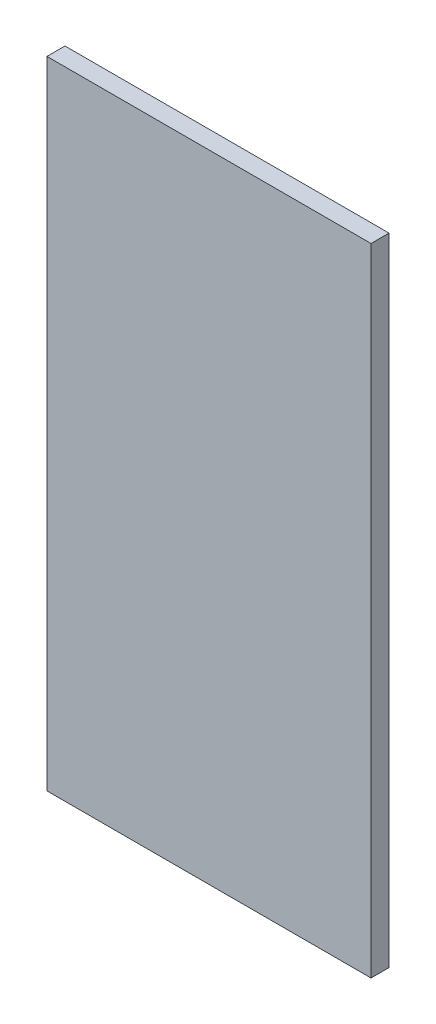
ISO-10303-21;
HEADER;
FILE_DESCRIPTION(('STEP AP214'),'2;1');
FILE_NAME('part.step','',(''),(''),'','','');
FILE_SCHEMA(('AUTOMOTIVE_DESIGN { 1 0 10303 214 1 1 1 1 }'));
ENDSEC;
DATA;
#1=APPLICATION_CONTEXT('core data for automotive mechanical design processes');
#2=APPLICATION_PROTOCOL_DEFINITION('international standard','automotive_design',2000,#1);
#3=PRODUCT_CONTEXT('',#1,'mechanical');
#4=PRODUCT('Part','Part','',(#3));
#5=PRODUCT_RELATED_PRODUCT_CATEGORY('part','',(#4));
#6=PRODUCT_DEFINITION_FORMATION('','',#4);
#7=PRODUCT_DEFINITION_CONTEXT('part definition',#1,'design');
#8=PRODUCT_DEFINITION('design','',#6,#7);
#9=PRODUCT_DEFINITION_SHAPE('','',#8);
#10=(LENGTH_UNIT() NAMED_UNIT(*) SI_UNIT(.MILLI.,.METRE.));
#11=(NAMED_UNIT(*) PLANE_ANGLE_UNIT() SI_UNIT($,.RADIAN.));
#12=(NAMED_UNIT(*) SI_UNIT($,.STERADIAN.) SOLID_ANGLE_UNIT());
#13=UNCERTAINTY_MEASURE_WITH_UNIT(LENGTH_MEASURE(1.E-05),#10,'distance_accuracy_value','');
#14=(GEOMETRIC_REPRESENTATION_CONTEXT(3) GLOBAL_UNCERTAINTY_ASSIGNED_CONTEXT((#13)) GLOBAL_UNIT_ASSIGNED_CONTEXT((#10,
#11,#12)) REPRESENTATION_CONTEXT('',''));
#15=CARTESIAN_POINT('',(0.,0.,0.));
#16=DIRECTION('',(0.,0.,1.));
#17=DIRECTION('',(1.,0.,0.));
#18=AXIS2_PLACEMENT_3D('',#15,#16,#17);
#19=CARTESIAN_POINT('',(0.,0.,15.));
#20=DIRECTION('',(1.,0.,0.));
#21=DIRECTION('',(0.,1.,0.));
#22=AXIS2_PLACEMENT_3D('',#19,#20,#21);
#23=PLANE('',#22);
#24=DIRECTION('',(0.,-1.,0.));
#25=VECTOR('',#24,1.);
#26=CARTESIAN_POINT('',(0.,0.,0.));
#27=LINE('',#26,#25);
#28=CARTESIAN_POINT('',(-1.66533453693773E-13,530.,0.));
#29=VERTEX_POINT('',#28);
#30=CARTESIAN_POINT('',(0.,0.,0.));
#31=VERTEX_POINT('',#30);
#32=EDGE_CURVE('E96',#29,#31,#27,.T.);
#33=ORIENTED_EDGE('',*,*,#32,.T.);
#34=DIRECTION('',(0.,0.,-1.));
#35=VECTOR('',#34,1.);
#36=CARTESIAN_POINT('',(0.,0.,15.));
#37=LINE('',#36,#35);
#38=CARTESIAN_POINT('',(0.,0.,15.));
#39=VERTEX_POINT('',#38);
#40=EDGE_CURVE('E11',#39,#31,#37,.T.);
#41=ORIENTED_EDGE('',*,*,#40,.F.);
#42=DIRECTION('',(0.,-1.,0.));
#43=VECTOR('',#42,1.);
#44=CARTESIAN_POINT('',(0.,0.,15.));
#45=LINE('',#44,#43);
#46=CARTESIAN_POINT('',(-1.66533453693773E-13,530.,15.));
#47=VERTEX_POINT('',#46);
#48=EDGE_CURVE('E84',#47,#39,#45,.T.);
#49=ORIENTED_EDGE('',*,*,#48,.F.);
#50=DIRECTION('',(0.,0.,-1.));
#51=VECTOR('',#50,1.);
#52=CARTESIAN_POINT('',(-1.66533453693773E-13,530.,15.));
#53=LINE('',#52,#51);
#54=EDGE_CURVE('E92',#47,#29,#53,.T.);
#55=ORIENTED_EDGE('',*,*,#54,.T.);
#56=EDGE_LOOP('',(#33,#41,#49,#55));
#57=FACE_BOUND('',#56,.T.);
#58=ADVANCED_FACE('F33',(#57),#23,.F.);
#59=CARTESIAN_POINT('',(0.,0.,15.));
#60=DIRECTION('',(0.,1.,0.));
#61=DIRECTION('',(0.,0.,1.));
#62=AXIS2_PLACEMENT_3D('',#59,#60,#61);
#63=PLANE('',#62);
#64=DIRECTION('',(1.,0.,0.));
#65=VECTOR('',#64,1.);
#66=CARTESIAN_POINT('',(0.,0.,0.));
#67=LINE('',#66,#65);
#68=CARTESIAN_POINT('',(270.,0.,0.));
#69=VERTEX_POINT('',#68);
#70=EDGE_CURVE('E88',#31,#69,#67,.T.);
#71=ORIENTED_EDGE('',*,*,#70,.T.);
#72=DIRECTION('',(0.,0.,-1.));
#73=VECTOR('',#72,1.);
#74=CARTESIAN_POINT('',(270.,0.,15.));
#75=LINE('',#74,#73);
#76=CARTESIAN_POINT('',(270.,0.,15.));
#77=VERTEX_POINT('',#76);
#78=EDGE_CURVE('E41',#77,#69,#75,.T.);
#79=ORIENTED_EDGE('',*,*,#78,.F.);
#80=DIRECTION('',(1.,0.,0.));
#81=VECTOR('',#80,1.);
#82=CARTESIAN_POINT('',(0.,0.,15.));
#83=LINE('',#82,#81);
#84=EDGE_CURVE('E79',#39,#77,#83,.T.);
#85=ORIENTED_EDGE('',*,*,#84,.F.);
#86=ORIENTED_EDGE('',*,*,#40,.T.);
#87=EDGE_LOOP('',(#71,#79,#85,#86));
#88=FACE_BOUND('',#87,.T.);
#89=ADVANCED_FACE('F87',(#88),#63,.F.);
#90=CARTESIAN_POINT('',(270.,0.,15.));
#91=DIRECTION('',(-1.,0.,0.));
#92=DIRECTION('',(0.,-1.,0.));
#93=AXIS2_PLACEMENT_3D('',#90,#91,#92);
#94=PLANE('',#93);
#95=DIRECTION('',(0.,1.,0.));
#96=VECTOR('',#95,1.);
#97=CARTESIAN_POINT('',(270.,0.,0.));
#98=LINE('',#97,#96);
#99=CARTESIAN_POINT('',(270.,530.,0.));
#100=VERTEX_POINT('',#99);
#101=EDGE_CURVE('E66',#69,#100,#98,.T.);
#102=ORIENTED_EDGE('',*,*,#101,.T.);
#103=DIRECTION('',(0.,0.,-1.));
#104=VECTOR('',#103,1.);
#105=CARTESIAN_POINT('',(270.,530.,15.));
#106=LINE('',#105,#104);
#107=CARTESIAN_POINT('',(270.,530.,15.));
#108=VERTEX_POINT('',#107);
#109=EDGE_CURVE('E89',#108,#100,#106,.T.);
#110=ORIENTED_EDGE('',*,*,#109,.F.);
#111=DIRECTION('',(0.,1.,0.));
#112=VECTOR('',#111,1.);
#113=CARTESIAN_POINT('',(270.,0.,15.));
#114=LINE('',#113,#112);
#115=EDGE_CURVE('E82',#77,#108,#114,.T.);
#116=ORIENTED_EDGE('',*,*,#115,.F.);
#117=ORIENTED_EDGE('',*,*,#78,.T.);
#118=EDGE_LOOP('',(#102,#110,#116,#117));
#119=FACE_BOUND('',#118,.T.);
#120=ADVANCED_FACE('F90',(#119),#94,.F.);
#121=CARTESIAN_POINT('',(-1.66533453693773E-13,530.,15.));
#122=DIRECTION('',(0.,-1.,0.));
#123=DIRECTION('',(0.,0.,-1.));
#124=AXIS2_PLACEMENT_3D('',#121,#122,#123);
#125=PLANE('',#124);
#126=DIRECTION('',(-1.,0.,0.));
#127=VECTOR('',#126,1.);
#128=CARTESIAN_POINT('',(-1.66533453693773E-13,530.,0.));
#129=LINE('',#128,#127);
#130=EDGE_CURVE('E72',#100,#29,#129,.T.);
#131=ORIENTED_EDGE('',*,*,#130,.T.);
#132=ORIENTED_EDGE('',*,*,#54,.F.);
#133=DIRECTION('',(-1.,0.,0.));
#134=VECTOR('',#133,1.);
#135=CARTESIAN_POINT('',(-1.66533453693773E-13,530.,15.));
#136=LINE('',#135,#134);
#137=EDGE_CURVE('E49',#108,#47,#136,.T.);
#138=ORIENTED_EDGE('',*,*,#137,.F.);
#139=ORIENTED_EDGE('',*,*,#109,.T.);
#140=EDGE_LOOP('',(#131,#132,#138,#139));
#141=FACE_BOUND('',#140,.T.);
#142=ADVANCED_FACE('F103',(#141),#125,.F.);
#143=CARTESIAN_POINT('',(0.,0.,15.));
#144=DIRECTION('',(0.,0.,-1.));
#145=DIRECTION('',(-1.,0.,0.));
#146=AXIS2_PLACEMENT_3D('',#143,#144,#145);
#147=PLANE('',#146);
#148=ORIENTED_EDGE('',*,*,#48,.T.);
#149=ORIENTED_EDGE('',*,*,#84,.T.);
#150=ORIENTED_EDGE('',*,*,#115,.T.);
#151=ORIENTED_EDGE('',*,*,#137,.T.);
#152=EDGE_LOOP('',(#148,#149,#150,#151));
#153=FACE_BOUND('',#152,.T.);
#154=ADVANCED_FACE('F80',(#153),#147,.F.);
#155=CARTESIAN_POINT('',(0.,0.,0.));
#156=DIRECTION('',(0.,0.,-1.));
#157=DIRECTION('',(-1.,0.,0.));
#158=AXIS2_PLACEMENT_3D('',#155,#156,#157);
#159=PLANE('',#158);
#160=ORIENTED_EDGE('',*,*,#32,.F.);
#161=ORIENTED_EDGE('',*,*,#130,.F.);
#162=ORIENTED_EDGE('',*,*,#101,.F.);
#163=ORIENTED_EDGE('',*,*,#70,.F.);
#164=EDGE_LOOP('',(#160,#161,#162,#163));
#165=FACE_BOUND('',#164,.T.);
#166=ADVANCED_FACE('F106',(#165),#159,.T.);
#167=CLOSED_SHELL('',(#58,#89,#120,#142,#154,#166));
#168=MANIFOLD_SOLID_BREP('B2',#167);
#169=ADVANCED_BREP_SHAPE_REPRESENTATION('',(#18,#168),#14);
#170=SHAPE_DEFINITION_REPRESENTATION(#9,#169);
ENDSEC;
END-ISO-10303-21;
